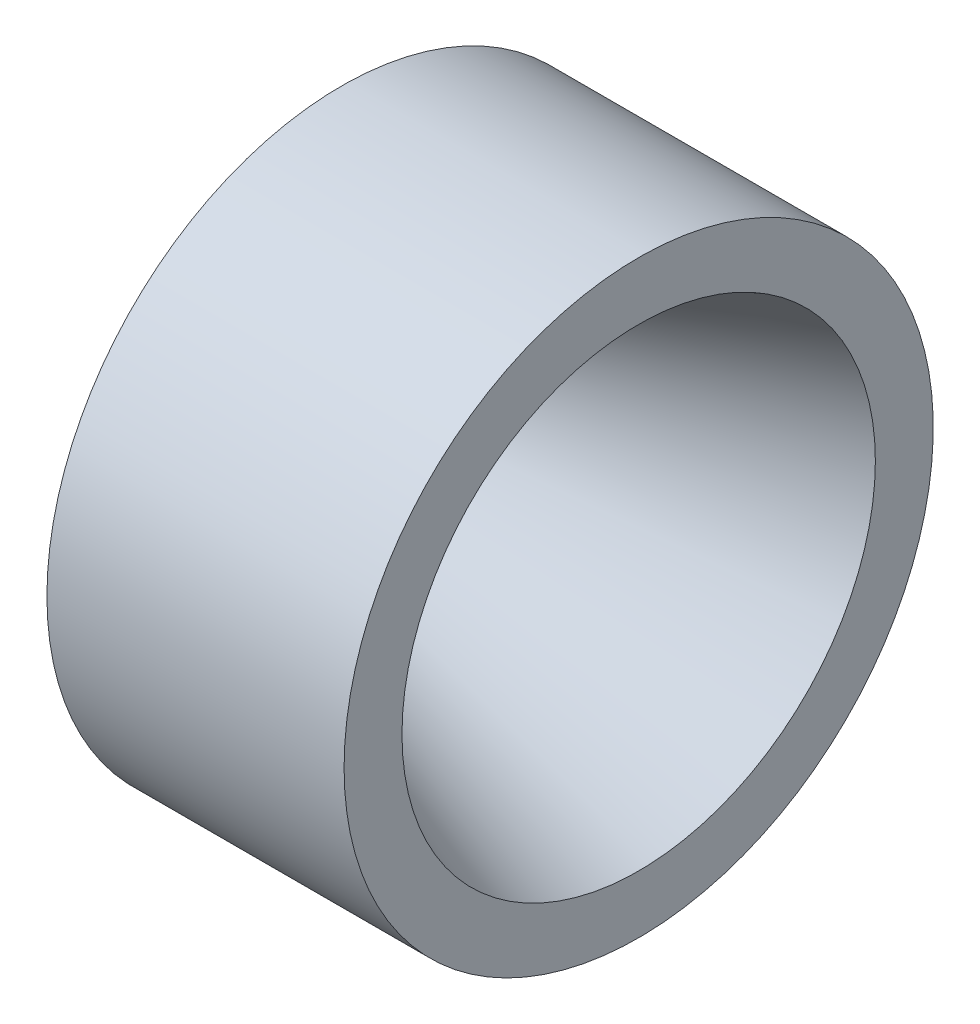
ISO-10303-21;
HEADER;
FILE_DESCRIPTION(('STEP AP214'),'2;1');
FILE_NAME('part.step','',(''),(''),'','','');
FILE_SCHEMA(('AUTOMOTIVE_DESIGN { 1 0 10303 214 1 1 1 1 }'));
ENDSEC;
DATA;
#1=APPLICATION_CONTEXT('core data for automotive mechanical design processes');
#2=APPLICATION_PROTOCOL_DEFINITION('international standard','automotive_design',2000,#1);
#3=PRODUCT_CONTEXT('',#1,'mechanical');
#4=PRODUCT('Part','Part','',(#3));
#5=PRODUCT_RELATED_PRODUCT_CATEGORY('part','',(#4));
#6=PRODUCT_DEFINITION_FORMATION('','',#4);
#7=PRODUCT_DEFINITION_CONTEXT('part definition',#1,'design');
#8=PRODUCT_DEFINITION('design','',#6,#7);
#9=PRODUCT_DEFINITION_SHAPE('','',#8);
#10=(LENGTH_UNIT() NAMED_UNIT(*) SI_UNIT(.MILLI.,.METRE.));
#11=(NAMED_UNIT(*) PLANE_ANGLE_UNIT() SI_UNIT($,.RADIAN.));
#12=(NAMED_UNIT(*) SI_UNIT($,.STERADIAN.) SOLID_ANGLE_UNIT());
#13=UNCERTAINTY_MEASURE_WITH_UNIT(LENGTH_MEASURE(1.E-05),#10,'distance_accuracy_value','');
#14=(GEOMETRIC_REPRESENTATION_CONTEXT(3) GLOBAL_UNCERTAINTY_ASSIGNED_CONTEXT((#13)) GLOBAL_UNIT_ASSIGNED_CONTEXT((#10,
#11,#12)) REPRESENTATION_CONTEXT('',''));
#15=CARTESIAN_POINT('',(0.,0.,0.));
#16=DIRECTION('',(0.,0.,1.));
#17=DIRECTION('',(1.,0.,0.));
#18=AXIS2_PLACEMENT_3D('',#15,#16,#17);
#19=CARTESIAN_POINT('',(280.911030354224,50.8,0.));
#20=DIRECTION('',(1.,0.,0.));
#21=DIRECTION('',(0.,0.,-1.));
#22=AXIS2_PLACEMENT_3D('',#19,#20,#21);
#23=PLANE('',#22);
#24=CARTESIAN_POINT('',(280.911030354224,29.8449999999999,-51.6930563518932));
#25=DIRECTION('',(-1.,0.,0.));
#26=DIRECTION('',(0.,0.86602540378444,0.499999999999998));
#27=AXIS2_PLACEMENT_3D('',#24,#25,#26);
#28=CIRCLE('',#27,2.54);
#29=CARTESIAN_POINT('',(280.911030354224,32.0447045256124,-50.4230563518932));
#30=VERTEX_POINT('',#29);
#31=EDGE_CURVE('E133',#30,#30,#28,.T.);
#32=ORIENTED_EDGE('',*,*,#31,.F.);
#33=EDGE_LOOP('',(#32));
#34=FACE_BOUND('',#33,.T.);
#35=CARTESIAN_POINT('',(280.911030354224,-2.08406521115547E-13,-59.69));
#36=DIRECTION('',(-1.,0.,0.));
#37=DIRECTION('',(0.,1.,0.));
#38=AXIS2_PLACEMENT_3D('',#35,#36,#37);
#39=CIRCLE('',#38,2.54);
#40=CARTESIAN_POINT('',(280.911030354224,2.53999999999979,-59.69));
#41=VERTEX_POINT('',#40);
#42=EDGE_CURVE('E125',#41,#41,#39,.T.);
#43=ORIENTED_EDGE('',*,*,#42,.F.);
#44=EDGE_LOOP('',(#43));
#45=FACE_BOUND('',#44,.T.);
#46=CARTESIAN_POINT('',(280.911030354224,-29.8450000000002,-51.693056351893));
#47=DIRECTION('',(-1.,0.,0.));
#48=DIRECTION('',(0.,0.866025403784436,-0.500000000000004));
#49=AXIS2_PLACEMENT_3D('',#46,#47,#48);
#50=CIRCLE('',#49,2.54);
#51=CARTESIAN_POINT('',(280.911030354224,-27.6452954743878,-52.963056351893));
#52=VERTEX_POINT('',#51);
#53=EDGE_CURVE('E117',#52,#52,#50,.T.);
#54=ORIENTED_EDGE('',*,*,#53,.F.);
#55=EDGE_LOOP('',(#54));
#56=FACE_BOUND('',#55,.T.);
#57=CARTESIAN_POINT('',(280.911030354224,-51.6930563518933,-29.8449999999997));
#58=DIRECTION('',(-1.,0.,0.));
#59=DIRECTION('',(0.,0.499999999999995,-0.866025403784442));
#60=AXIS2_PLACEMENT_3D('',#57,#58,#59);
#61=CIRCLE('',#60,2.54);
#62=CARTESIAN_POINT('',(280.911030354224,-50.4230563518933,-32.0447045256122));
#63=VERTEX_POINT('',#62);
#64=EDGE_CURVE('E109',#63,#63,#61,.T.);
#65=ORIENTED_EDGE('',*,*,#64,.F.);
#66=EDGE_LOOP('',(#65));
#67=FACE_BOUND('',#66,.T.);
#68=CARTESIAN_POINT('',(280.911030354224,-59.69,0.));
#69=DIRECTION('',(-1.,0.,0.));
#70=DIRECTION('',(0.,0.,-1.));
#71=AXIS2_PLACEMENT_3D('',#68,#69,#70);
#72=CIRCLE('',#71,2.54);
#73=CARTESIAN_POINT('',(280.911030354224,-59.69,-2.54));
#74=VERTEX_POINT('',#73);
#75=EDGE_CURVE('E101',#74,#74,#72,.T.);
#76=ORIENTED_EDGE('',*,*,#75,.F.);
#77=EDGE_LOOP('',(#76));
#78=FACE_BOUND('',#77,.T.);
#79=CARTESIAN_POINT('',(280.911030354224,-51.6930563518929,29.8450000000004));
#80=DIRECTION('',(-1.,0.,0.));
#81=DIRECTION('',(0.,-0.500000000000007,-0.866025403784435));
#82=AXIS2_PLACEMENT_3D('',#79,#80,#81);
#83=CIRCLE('',#82,2.54);
#84=CARTESIAN_POINT('',(280.911030354224,-52.9630563518929,27.645295474388));
#85=VERTEX_POINT('',#84);
#86=EDGE_CURVE('E93',#85,#85,#83,.T.);
#87=ORIENTED_EDGE('',*,*,#86,.F.);
#88=EDGE_LOOP('',(#87));
#89=FACE_BOUND('',#88,.T.);
#90=CARTESIAN_POINT('',(280.911030354224,-29.8449999999995,51.6930563518934));
#91=DIRECTION('',(-1.,0.,0.));
#92=DIRECTION('',(0.,-0.866025403784443,-0.499999999999992));
#93=AXIS2_PLACEMENT_3D('',#90,#91,#92);
#94=CIRCLE('',#93,2.54);
#95=CARTESIAN_POINT('',(280.911030354224,-32.044704525612,50.4230563518934));
#96=VERTEX_POINT('',#95);
#97=EDGE_CURVE('E85',#96,#96,#94,.T.);
#98=ORIENTED_EDGE('',*,*,#97,.F.);
#99=EDGE_LOOP('',(#98));
#100=FACE_BOUND('',#99,.T.);
#101=CARTESIAN_POINT('',(280.911030354224,6.2521956334664E-13,59.69));
#102=DIRECTION('',(-1.,0.,0.));
#103=DIRECTION('',(0.,-1.,0.));
#104=AXIS2_PLACEMENT_3D('',#101,#102,#103);
#105=CIRCLE('',#104,2.54);
#106=CARTESIAN_POINT('',(280.911030354224,-2.53999999999938,59.69));
#107=VERTEX_POINT('',#106);
#108=EDGE_CURVE('E76',#107,#107,#105,.T.);
#109=ORIENTED_EDGE('',*,*,#108,.F.);
#110=EDGE_LOOP('',(#109));
#111=FACE_BOUND('',#110,.T.);
#112=CARTESIAN_POINT('',(280.911030354224,29.8450000000006,51.6930563518928));
#113=DIRECTION('',(-1.,0.,0.));
#114=DIRECTION('',(0.,-0.866025403784433,0.50000000000001));
#115=AXIS2_PLACEMENT_3D('',#112,#113,#114);
#116=CIRCLE('',#115,2.54);
#117=CARTESIAN_POINT('',(280.911030354224,27.6452954743881,52.9630563518928));
#118=VERTEX_POINT('',#117);
#119=EDGE_CURVE('E148',#118,#118,#116,.T.);
#120=ORIENTED_EDGE('',*,*,#119,.F.);
#121=EDGE_LOOP('',(#120));
#122=FACE_BOUND('',#121,.T.);
#123=CARTESIAN_POINT('',(280.911030354224,51.6930563518935,29.8449999999993));
#124=DIRECTION('',(-1.,0.,0.));
#125=DIRECTION('',(0.,-0.499999999999989,0.866025403784445));
#126=AXIS2_PLACEMENT_3D('',#123,#124,#125);
#127=CIRCLE('',#126,2.54);
#128=CARTESIAN_POINT('',(280.911030354224,50.4230563518935,32.0447045256118));
#129=VERTEX_POINT('',#128);
#130=EDGE_CURVE('E140',#129,#129,#127,.T.);
#131=ORIENTED_EDGE('',*,*,#130,.F.);
#132=EDGE_LOOP('',(#131));
#133=FACE_BOUND('',#132,.T.);
#134=CARTESIAN_POINT('',(280.911030354224,51.6930563518931,-29.8450000000001));
#135=DIRECTION('',(-1.,0.,0.));
#136=DIRECTION('',(0.,0.500000000000001,0.866025403784438));
#137=AXIS2_PLACEMENT_3D('',#134,#135,#136);
#138=CIRCLE('',#137,2.54);
#139=CARTESIAN_POINT('',(280.911030354224,52.9630563518931,-27.6452954743876));
#140=VERTEX_POINT('',#139);
#141=EDGE_CURVE('E68',#140,#140,#138,.T.);
#142=ORIENTED_EDGE('',*,*,#141,.F.);
#143=EDGE_LOOP('',(#142));
#144=FACE_BOUND('',#143,.T.);
#145=CARTESIAN_POINT('',(280.911030354224,59.69,0.));
#146=DIRECTION('',(-1.,0.,0.));
#147=DIRECTION('',(0.,0.,1.));
#148=AXIS2_PLACEMENT_3D('',#145,#146,#147);
#149=CIRCLE('',#148,2.54);
#150=CARTESIAN_POINT('',(280.911030354224,59.69,2.54));
#151=VERTEX_POINT('',#150);
#152=EDGE_CURVE('E60',#151,#151,#149,.T.);
#153=ORIENTED_EDGE('',*,*,#152,.F.);
#154=EDGE_LOOP('',(#153));
#155=FACE_BOUND('',#154,.T.);
#156=CARTESIAN_POINT('',(280.911030354224,0.,0.));
#157=DIRECTION('',(-1.,0.,0.));
#158=DIRECTION('',(0.,0.,1.));
#159=AXIS2_PLACEMENT_3D('',#156,#157,#158);
#160=CIRCLE('',#159,30.48);
#161=CARTESIAN_POINT('',(280.911030354224,0.,30.48));
#162=VERTEX_POINT('',#161);
#163=EDGE_CURVE('E53',#162,#162,#160,.T.);
#164=ORIENTED_EDGE('',*,*,#163,.F.);
#165=EDGE_LOOP('',(#164));
#166=FACE_BOUND('',#165,.T.);
#167=CARTESIAN_POINT('',(280.911030354224,0.,0.));
#168=DIRECTION('',(-1.,0.,0.));
#169=DIRECTION('',(0.,0.,1.));
#170=AXIS2_PLACEMENT_3D('',#167,#168,#169);
#171=CIRCLE('',#170,69.85);
#172=CARTESIAN_POINT('',(280.911030354224,0.,69.85));
#173=VERTEX_POINT('',#172);
#174=EDGE_CURVE('E10',#173,#173,#171,.T.);
#175=ORIENTED_EDGE('',*,*,#174,.T.);
#176=EDGE_LOOP('',(#175));
#177=FACE_BOUND('',#176,.T.);
#178=ADVANCED_FACE('F36',(#34,#45,#56,#67,#78,#89,#100,#111,#122,#133,#144,#155,#166,#177),#23,.F.);
#179=CARTESIAN_POINT('',(0.,0.,0.));
#180=DIRECTION('',(-1.,0.,0.));
#181=DIRECTION('',(0.,0.,1.));
#182=AXIS2_PLACEMENT_3D('',#179,#180,#181);
#183=CYLINDRICAL_SURFACE('',#182,69.85);
#184=ORIENTED_EDGE('',*,*,#174,.F.);
#185=EDGE_LOOP('',(#184));
#186=FACE_BOUND('',#185,.T.);
#187=CARTESIAN_POINT('',(351.369552102032,0.,0.));
#188=DIRECTION('',(-1.,0.,0.));
#189=DIRECTION('',(0.,0.,1.));
#190=AXIS2_PLACEMENT_3D('',#187,#188,#189);
#191=CIRCLE('',#190,69.85);
#192=CARTESIAN_POINT('',(351.369552102032,0.,69.85));
#193=VERTEX_POINT('',#192);
#194=EDGE_CURVE('E43',#193,#193,#191,.T.);
#195=ORIENTED_EDGE('',*,*,#194,.T.);
#196=EDGE_LOOP('',(#195));
#197=FACE_BOUND('',#196,.T.);
#198=ADVANCED_FACE('F167',(#186,#197),#183,.T.);
#199=CARTESIAN_POINT('',(351.369552102032,56.1248046666,0.));
#200=DIRECTION('',(-1.,0.,0.));
#201=DIRECTION('',(0.,0.,1.));
#202=AXIS2_PLACEMENT_3D('',#199,#200,#201);
#203=PLANE('',#202);
#204=ORIENTED_EDGE('',*,*,#194,.F.);
#205=EDGE_LOOP('',(#204));
#206=FACE_BOUND('',#205,.T.);
#207=CARTESIAN_POINT('',(351.369552102032,0.,0.));
#208=DIRECTION('',(-1.,0.,0.));
#209=DIRECTION('',(0.,0.,1.));
#210=AXIS2_PLACEMENT_3D('',#207,#208,#209);
#211=CIRCLE('',#210,56.1248046666);
#212=CARTESIAN_POINT('',(351.369552102032,0.,56.1248046666));
#213=VERTEX_POINT('',#212);
#214=EDGE_CURVE('E48',#213,#213,#211,.T.);
#215=ORIENTED_EDGE('',*,*,#214,.T.);
#216=EDGE_LOOP('',(#215));
#217=FACE_BOUND('',#216,.T.);
#218=ADVANCED_FACE('F180',(#206,#217),#203,.F.);
#219=CARTESIAN_POINT('',(280.911030354224,0.,0.));
#220=DIRECTION('',(1.,0.,0.));
#221=DIRECTION('',(0.,0.,-1.));
#222=AXIS2_PLACEMENT_3D('',#219,#220,#221);
#223=CONICAL_SURFACE('',#222,30.48,0.349065850398867);
#224=ORIENTED_EDGE('',*,*,#214,.F.);
#225=EDGE_LOOP('',(#224));
#226=FACE_BOUND('',#225,.T.);
#227=ORIENTED_EDGE('',*,*,#163,.T.);
#228=EDGE_LOOP('',(#227));
#229=FACE_BOUND('',#228,.T.);
#230=ADVANCED_FACE('F177',(#226,#229),#223,.F.);
#231=CARTESIAN_POINT('',(311.391030354224,59.69,0.));
#232=DIRECTION('',(-1.,0.,0.));
#233=DIRECTION('',(0.,0.,1.));
#234=AXIS2_PLACEMENT_3D('',#231,#232,#233);
#235=CYLINDRICAL_SURFACE('',#234,2.54);
#236=CARTESIAN_POINT('',(311.391030354224,59.69,0.));
#237=DIRECTION('',(-1.,0.,0.));
#238=DIRECTION('',(0.,0.,1.));
#239=AXIS2_PLACEMENT_3D('',#236,#237,#238);
#240=CIRCLE('',#239,2.54);
#241=CARTESIAN_POINT('',(311.391030354224,59.69,2.54));
#242=VERTEX_POINT('',#241);
#243=EDGE_CURVE('E59',#242,#242,#240,.T.);
#244=ORIENTED_EDGE('',*,*,#243,.F.);
#245=EDGE_LOOP('',(#244));
#246=FACE_BOUND('',#245,.T.);
#247=ORIENTED_EDGE('',*,*,#152,.T.);
#248=EDGE_LOOP('',(#247));
#249=FACE_BOUND('',#248,.T.);
#250=ADVANCED_FACE('F179',(#246,#249),#235,.F.);
#251=CARTESIAN_POINT('',(311.391030354224,0.,0.));
#252=DIRECTION('',(-1.,0.,0.));
#253=DIRECTION('',(0.,0.,1.));
#254=AXIS2_PLACEMENT_3D('',#251,#252,#253);
#255=PLANE('',#254);
#256=ORIENTED_EDGE('',*,*,#243,.T.);
#257=EDGE_LOOP('',(#256));
#258=FACE_BOUND('',#257,.T.);
#259=ADVANCED_FACE('F187',(#258),#255,.T.);
#260=CARTESIAN_POINT('',(311.391030354224,51.6930563518931,-29.8450000000001));
#261=DIRECTION('',(-1.,0.,0.));
#262=DIRECTION('',(0.,0.,1.));
#263=AXIS2_PLACEMENT_3D('',#260,#261,#262);
#264=CYLINDRICAL_SURFACE('',#263,2.54);
#265=CARTESIAN_POINT('',(311.391030354224,51.6930563518931,-29.8450000000001));
#266=DIRECTION('',(-1.,0.,0.));
#267=DIRECTION('',(0.,0.500000000000001,0.866025403784438));
#268=AXIS2_PLACEMENT_3D('',#265,#266,#267);
#269=CIRCLE('',#268,2.54);
#270=CARTESIAN_POINT('',(311.391030354224,52.9630563518931,-27.6452954743876));
#271=VERTEX_POINT('',#270);
#272=EDGE_CURVE('E64',#271,#271,#269,.T.);
#273=ORIENTED_EDGE('',*,*,#272,.F.);
#274=EDGE_LOOP('',(#273));
#275=FACE_BOUND('',#274,.T.);
#276=ORIENTED_EDGE('',*,*,#141,.T.);
#277=EDGE_LOOP('',(#276));
#278=FACE_BOUND('',#277,.T.);
#279=ADVANCED_FACE('F223',(#275,#278),#264,.F.);
#280=CARTESIAN_POINT('',(311.391030354224,0.,0.));
#281=DIRECTION('',(-1.,0.,0.));
#282=DIRECTION('',(0.,0.500000000000001,0.866025403784438));
#283=AXIS2_PLACEMENT_3D('',#280,#281,#282);
#284=PLANE('',#283);
#285=ORIENTED_EDGE('',*,*,#272,.T.);
#286=EDGE_LOOP('',(#285));
#287=FACE_BOUND('',#286,.T.);
#288=ADVANCED_FACE('F234',(#287),#284,.T.);
#289=CARTESIAN_POINT('',(311.391030354224,51.6930563518935,29.8449999999993));
#290=DIRECTION('',(-1.,0.,0.));
#291=DIRECTION('',(0.,0.,1.));
#292=AXIS2_PLACEMENT_3D('',#289,#290,#291);
#293=CYLINDRICAL_SURFACE('',#292,2.54);
#294=CARTESIAN_POINT('',(311.391030354224,51.6930563518935,29.8449999999993));
#295=DIRECTION('',(-1.,0.,0.));
#296=DIRECTION('',(0.,-0.499999999999989,0.866025403784445));
#297=AXIS2_PLACEMENT_3D('',#294,#295,#296);
#298=CIRCLE('',#297,2.54);
#299=CARTESIAN_POINT('',(311.391030354224,50.4230563518935,32.0447045256118));
#300=VERTEX_POINT('',#299);
#301=EDGE_CURVE('E144',#300,#300,#298,.T.);
#302=ORIENTED_EDGE('',*,*,#301,.F.);
#303=EDGE_LOOP('',(#302));
#304=FACE_BOUND('',#303,.T.);
#305=ORIENTED_EDGE('',*,*,#130,.T.);
#306=EDGE_LOOP('',(#305));
#307=FACE_BOUND('',#306,.T.);
#308=ADVANCED_FACE('F244',(#304,#307),#293,.F.);
#309=CARTESIAN_POINT('',(311.391030354224,0.,0.));
#310=DIRECTION('',(-1.,0.,0.));
#311=DIRECTION('',(0.,-0.499999999999989,0.866025403784445));
#312=AXIS2_PLACEMENT_3D('',#309,#310,#311);
#313=PLANE('',#312);
#314=ORIENTED_EDGE('',*,*,#301,.T.);
#315=EDGE_LOOP('',(#314));
#316=FACE_BOUND('',#315,.T.);
#317=ADVANCED_FACE('F161',(#316),#313,.T.);
#318=CARTESIAN_POINT('',(311.391030354224,29.8450000000006,51.6930563518928));
#319=DIRECTION('',(-1.,0.,0.));
#320=DIRECTION('',(0.,0.,1.));
#321=AXIS2_PLACEMENT_3D('',#318,#319,#320);
#322=CYLINDRICAL_SURFACE('',#321,2.54);
#323=CARTESIAN_POINT('',(311.391030354224,29.8450000000006,51.6930563518928));
#324=DIRECTION('',(-1.,0.,0.));
#325=DIRECTION('',(0.,-0.866025403784433,0.50000000000001));
#326=AXIS2_PLACEMENT_3D('',#323,#324,#325);
#327=CIRCLE('',#326,2.54);
#328=CARTESIAN_POINT('',(311.391030354224,27.6452954743881,52.9630563518928));
#329=VERTEX_POINT('',#328);
#330=EDGE_CURVE('E81',#329,#329,#327,.T.);
#331=ORIENTED_EDGE('',*,*,#330,.F.);
#332=EDGE_LOOP('',(#331));
#333=FACE_BOUND('',#332,.T.);
#334=ORIENTED_EDGE('',*,*,#119,.T.);
#335=EDGE_LOOP('',(#334));
#336=FACE_BOUND('',#335,.T.);
#337=ADVANCED_FACE('F158',(#333,#336),#322,.F.);
#338=CARTESIAN_POINT('',(311.391030354224,0.,0.));
#339=DIRECTION('',(-1.,0.,0.));
#340=DIRECTION('',(0.,-0.866025403784433,0.50000000000001));
#341=AXIS2_PLACEMENT_3D('',#338,#339,#340);
#342=PLANE('',#341);
#343=ORIENTED_EDGE('',*,*,#330,.T.);
#344=EDGE_LOOP('',(#343));
#345=FACE_BOUND('',#344,.T.);
#346=ADVANCED_FACE('F156',(#345),#342,.T.);
#347=CARTESIAN_POINT('',(311.391030354224,6.2521956334664E-13,59.69));
#348=DIRECTION('',(-1.,0.,0.));
#349=DIRECTION('',(0.,0.,1.));
#350=AXIS2_PLACEMENT_3D('',#347,#348,#349);
#351=CYLINDRICAL_SURFACE('',#350,2.54);
#352=CARTESIAN_POINT('',(311.391030354224,6.2521956334664E-13,59.69));
#353=DIRECTION('',(-1.,0.,0.));
#354=DIRECTION('',(0.,-1.,0.));
#355=AXIS2_PLACEMENT_3D('',#352,#353,#354);
#356=CIRCLE('',#355,2.54);
#357=CARTESIAN_POINT('',(311.391030354224,-2.53999999999938,59.69));
#358=VERTEX_POINT('',#357);
#359=EDGE_CURVE('E80',#358,#358,#356,.T.);
#360=ORIENTED_EDGE('',*,*,#359,.F.);
#361=EDGE_LOOP('',(#360));
#362=FACE_BOUND('',#361,.T.);
#363=ORIENTED_EDGE('',*,*,#108,.T.);
#364=EDGE_LOOP('',(#363));
#365=FACE_BOUND('',#364,.T.);
#366=ADVANCED_FACE('F278',(#362,#365),#351,.F.);
#367=CARTESIAN_POINT('',(311.391030354224,0.,0.));
#368=DIRECTION('',(-1.,0.,0.));
#369=DIRECTION('',(0.,-1.,0.));
#370=AXIS2_PLACEMENT_3D('',#367,#368,#369);
#371=PLANE('',#370);
#372=ORIENTED_EDGE('',*,*,#359,.T.);
#373=EDGE_LOOP('',(#372));
#374=FACE_BOUND('',#373,.T.);
#375=ADVANCED_FACE('F287',(#374),#371,.T.);
#376=CARTESIAN_POINT('',(311.391030354224,-29.8449999999995,51.6930563518934));
#377=DIRECTION('',(-1.,0.,0.));
#378=DIRECTION('',(0.,0.,1.));
#379=AXIS2_PLACEMENT_3D('',#376,#377,#378);
#380=CYLINDRICAL_SURFACE('',#379,2.54);
#381=CARTESIAN_POINT('',(311.391030354224,-29.8449999999995,51.6930563518934));
#382=DIRECTION('',(-1.,0.,0.));
#383=DIRECTION('',(0.,-0.866025403784443,-0.499999999999992));
#384=AXIS2_PLACEMENT_3D('',#381,#382,#383);
#385=CIRCLE('',#384,2.54);
#386=CARTESIAN_POINT('',(311.391030354224,-32.044704525612,50.4230563518934));
#387=VERTEX_POINT('',#386);
#388=EDGE_CURVE('E89',#387,#387,#385,.T.);
#389=ORIENTED_EDGE('',*,*,#388,.F.);
#390=EDGE_LOOP('',(#389));
#391=FACE_BOUND('',#390,.T.);
#392=ORIENTED_EDGE('',*,*,#97,.T.);
#393=EDGE_LOOP('',(#392));
#394=FACE_BOUND('',#393,.T.);
#395=ADVANCED_FACE('F297',(#391,#394),#380,.F.);
#396=CARTESIAN_POINT('',(311.391030354224,0.,0.));
#397=DIRECTION('',(-1.,0.,0.));
#398=DIRECTION('',(0.,-0.866025403784443,-0.499999999999992));
#399=AXIS2_PLACEMENT_3D('',#396,#397,#398);
#400=PLANE('',#399);
#401=ORIENTED_EDGE('',*,*,#388,.T.);
#402=EDGE_LOOP('',(#401));
#403=FACE_BOUND('',#402,.T.);
#404=ADVANCED_FACE('F307',(#403),#400,.T.);
#405=CARTESIAN_POINT('',(311.391030354224,-51.6930563518929,29.8450000000004));
#406=DIRECTION('',(-1.,0.,0.));
#407=DIRECTION('',(0.,0.,1.));
#408=AXIS2_PLACEMENT_3D('',#405,#406,#407);
#409=CYLINDRICAL_SURFACE('',#408,2.54);
#410=CARTESIAN_POINT('',(311.391030354224,-51.6930563518929,29.8450000000004));
#411=DIRECTION('',(-1.,0.,0.));
#412=DIRECTION('',(0.,-0.500000000000007,-0.866025403784435));
#413=AXIS2_PLACEMENT_3D('',#410,#411,#412);
#414=CIRCLE('',#413,2.54);
#415=CARTESIAN_POINT('',(311.391030354224,-52.9630563518929,27.645295474388));
#416=VERTEX_POINT('',#415);
#417=EDGE_CURVE('E97',#416,#416,#414,.T.);
#418=ORIENTED_EDGE('',*,*,#417,.F.);
#419=EDGE_LOOP('',(#418));
#420=FACE_BOUND('',#419,.T.);
#421=ORIENTED_EDGE('',*,*,#86,.T.);
#422=EDGE_LOOP('',(#421));
#423=FACE_BOUND('',#422,.T.);
#424=ADVANCED_FACE('F317',(#420,#423),#409,.F.);
#425=CARTESIAN_POINT('',(311.391030354224,0.,0.));
#426=DIRECTION('',(-1.,0.,0.));
#427=DIRECTION('',(0.,-0.500000000000007,-0.866025403784435));
#428=AXIS2_PLACEMENT_3D('',#425,#426,#427);
#429=PLANE('',#428);
#430=ORIENTED_EDGE('',*,*,#417,.T.);
#431=EDGE_LOOP('',(#430));
#432=FACE_BOUND('',#431,.T.);
#433=ADVANCED_FACE('F327',(#432),#429,.T.);
#434=CARTESIAN_POINT('',(311.391030354224,-59.69,0.));
#435=DIRECTION('',(-1.,0.,0.));
#436=DIRECTION('',(0.,0.,1.));
#437=AXIS2_PLACEMENT_3D('',#434,#435,#436);
#438=CYLINDRICAL_SURFACE('',#437,2.54);
#439=CARTESIAN_POINT('',(311.391030354224,-59.69,0.));
#440=DIRECTION('',(-1.,0.,0.));
#441=DIRECTION('',(0.,0.,-1.));
#442=AXIS2_PLACEMENT_3D('',#439,#440,#441);
#443=CIRCLE('',#442,2.54);
#444=CARTESIAN_POINT('',(311.391030354224,-59.69,-2.54));
#445=VERTEX_POINT('',#444);
#446=EDGE_CURVE('E105',#445,#445,#443,.T.);
#447=ORIENTED_EDGE('',*,*,#446,.F.);
#448=EDGE_LOOP('',(#447));
#449=FACE_BOUND('',#448,.T.);
#450=ORIENTED_EDGE('',*,*,#75,.T.);
#451=EDGE_LOOP('',(#450));
#452=FACE_BOUND('',#451,.T.);
#453=ADVANCED_FACE('F337',(#449,#452),#438,.F.);
#454=CARTESIAN_POINT('',(311.391030354224,0.,0.));
#455=DIRECTION('',(-1.,0.,0.));
#456=DIRECTION('',(0.,0.,-1.));
#457=AXIS2_PLACEMENT_3D('',#454,#455,#456);
#458=PLANE('',#457);
#459=ORIENTED_EDGE('',*,*,#446,.T.);
#460=EDGE_LOOP('',(#459));
#461=FACE_BOUND('',#460,.T.);
#462=ADVANCED_FACE('F347',(#461),#458,.T.);
#463=CARTESIAN_POINT('',(311.391030354224,-51.6930563518933,-29.8449999999997));
#464=DIRECTION('',(-1.,0.,0.));
#465=DIRECTION('',(0.,0.,1.));
#466=AXIS2_PLACEMENT_3D('',#463,#464,#465);
#467=CYLINDRICAL_SURFACE('',#466,2.54);
#468=CARTESIAN_POINT('',(311.391030354224,-51.6930563518933,-29.8449999999997));
#469=DIRECTION('',(-1.,0.,0.));
#470=DIRECTION('',(0.,0.499999999999995,-0.866025403784442));
#471=AXIS2_PLACEMENT_3D('',#468,#469,#470);
#472=CIRCLE('',#471,2.54);
#473=CARTESIAN_POINT('',(311.391030354224,-50.4230563518933,-32.0447045256122));
#474=VERTEX_POINT('',#473);
#475=EDGE_CURVE('E113',#474,#474,#472,.T.);
#476=ORIENTED_EDGE('',*,*,#475,.F.);
#477=EDGE_LOOP('',(#476));
#478=FACE_BOUND('',#477,.T.);
#479=ORIENTED_EDGE('',*,*,#64,.T.);
#480=EDGE_LOOP('',(#479));
#481=FACE_BOUND('',#480,.T.);
#482=ADVANCED_FACE('F357',(#478,#481),#467,.F.);
#483=CARTESIAN_POINT('',(311.391030354224,0.,0.));
#484=DIRECTION('',(-1.,0.,0.));
#485=DIRECTION('',(0.,0.499999999999995,-0.866025403784442));
#486=AXIS2_PLACEMENT_3D('',#483,#484,#485);
#487=PLANE('',#486);
#488=ORIENTED_EDGE('',*,*,#475,.T.);
#489=EDGE_LOOP('',(#488));
#490=FACE_BOUND('',#489,.T.);
#491=ADVANCED_FACE('F367',(#490),#487,.T.);
#492=CARTESIAN_POINT('',(311.391030354224,-29.8450000000002,-51.693056351893));
#493=DIRECTION('',(-1.,0.,0.));
#494=DIRECTION('',(0.,0.,1.));
#495=AXIS2_PLACEMENT_3D('',#492,#493,#494);
#496=CYLINDRICAL_SURFACE('',#495,2.54);
#497=CARTESIAN_POINT('',(311.391030354224,-29.8450000000002,-51.693056351893));
#498=DIRECTION('',(-1.,0.,0.));
#499=DIRECTION('',(0.,0.866025403784436,-0.500000000000004));
#500=AXIS2_PLACEMENT_3D('',#497,#498,#499);
#501=CIRCLE('',#500,2.54);
#502=CARTESIAN_POINT('',(311.391030354224,-27.6452954743878,-52.963056351893));
#503=VERTEX_POINT('',#502);
#504=EDGE_CURVE('E121',#503,#503,#501,.T.);
#505=ORIENTED_EDGE('',*,*,#504,.F.);
#506=EDGE_LOOP('',(#505));
#507=FACE_BOUND('',#506,.T.);
#508=ORIENTED_EDGE('',*,*,#53,.T.);
#509=EDGE_LOOP('',(#508));
#510=FACE_BOUND('',#509,.T.);
#511=ADVANCED_FACE('F377',(#507,#510),#496,.F.);
#512=CARTESIAN_POINT('',(311.391030354224,0.,0.));
#513=DIRECTION('',(-1.,0.,0.));
#514=DIRECTION('',(0.,0.866025403784436,-0.500000000000004));
#515=AXIS2_PLACEMENT_3D('',#512,#513,#514);
#516=PLANE('',#515);
#517=ORIENTED_EDGE('',*,*,#504,.T.);
#518=EDGE_LOOP('',(#517));
#519=FACE_BOUND('',#518,.T.);
#520=ADVANCED_FACE('F387',(#519),#516,.T.);
#521=CARTESIAN_POINT('',(311.391030354224,-2.08406521115547E-13,-59.69));
#522=DIRECTION('',(-1.,0.,0.));
#523=DIRECTION('',(0.,0.,1.));
#524=AXIS2_PLACEMENT_3D('',#521,#522,#523);
#525=CYLINDRICAL_SURFACE('',#524,2.54);
#526=CARTESIAN_POINT('',(311.391030354224,-2.08406521115547E-13,-59.69));
#527=DIRECTION('',(-1.,0.,0.));
#528=DIRECTION('',(0.,1.,0.));
#529=AXIS2_PLACEMENT_3D('',#526,#527,#528);
#530=CIRCLE('',#529,2.54);
#531=CARTESIAN_POINT('',(311.391030354224,2.53999999999979,-59.69));
#532=VERTEX_POINT('',#531);
#533=EDGE_CURVE('E129',#532,#532,#530,.T.);
#534=ORIENTED_EDGE('',*,*,#533,.F.);
#535=EDGE_LOOP('',(#534));
#536=FACE_BOUND('',#535,.T.);
#537=ORIENTED_EDGE('',*,*,#42,.T.);
#538=EDGE_LOOP('',(#537));
#539=FACE_BOUND('',#538,.T.);
#540=ADVANCED_FACE('F397',(#536,#539),#525,.F.);
#541=CARTESIAN_POINT('',(311.391030354224,0.,0.));
#542=DIRECTION('',(-1.,0.,0.));
#543=DIRECTION('',(0.,1.,0.));
#544=AXIS2_PLACEMENT_3D('',#541,#542,#543);
#545=PLANE('',#544);
#546=ORIENTED_EDGE('',*,*,#533,.T.);
#547=EDGE_LOOP('',(#546));
#548=FACE_BOUND('',#547,.T.);
#549=ADVANCED_FACE('F407',(#548),#545,.T.);
#550=CARTESIAN_POINT('',(311.391030354224,29.8449999999999,-51.6930563518932));
#551=DIRECTION('',(-1.,0.,0.));
#552=DIRECTION('',(0.,0.,1.));
#553=AXIS2_PLACEMENT_3D('',#550,#551,#552);
#554=CYLINDRICAL_SURFACE('',#553,2.54);
#555=CARTESIAN_POINT('',(311.391030354224,29.8449999999999,-51.6930563518932));
#556=DIRECTION('',(-1.,0.,0.));
#557=DIRECTION('',(0.,0.86602540378444,0.499999999999998));
#558=AXIS2_PLACEMENT_3D('',#555,#556,#557);
#559=CIRCLE('',#558,2.54);
#560=CARTESIAN_POINT('',(311.391030354224,32.0447045256124,-50.4230563518932));
#561=VERTEX_POINT('',#560);
#562=EDGE_CURVE('E72',#561,#561,#559,.T.);
#563=ORIENTED_EDGE('',*,*,#562,.F.);
#564=EDGE_LOOP('',(#563));
#565=FACE_BOUND('',#564,.T.);
#566=ORIENTED_EDGE('',*,*,#31,.T.);
#567=EDGE_LOOP('',(#566));
#568=FACE_BOUND('',#567,.T.);
#569=ADVANCED_FACE('F417',(#565,#568),#554,.F.);
#570=CARTESIAN_POINT('',(311.391030354224,0.,0.));
#571=DIRECTION('',(-1.,0.,0.));
#572=DIRECTION('',(0.,0.86602540378444,0.499999999999998));
#573=AXIS2_PLACEMENT_3D('',#570,#571,#572);
#574=PLANE('',#573);
#575=ORIENTED_EDGE('',*,*,#562,.T.);
#576=EDGE_LOOP('',(#575));
#577=FACE_BOUND('',#576,.T.);
#578=ADVANCED_FACE('F427',(#577),#574,.T.);
#579=CLOSED_SHELL('',(#178,#198,#218,#230,#250,#259,#279,#288,#308,#317,#337,#346,#366,#375,
#395,#404,#424,#433,#453,#462,#482,#491,#511,#520,#540,#549,#569,#578));
#580=MANIFOLD_SOLID_BREP('B2',#579);
#581=ADVANCED_BREP_SHAPE_REPRESENTATION('',(#18,#580),#14);
#582=SHAPE_DEFINITION_REPRESENTATION(#9,#581);
ENDSEC;
END-ISO-10303-21;
